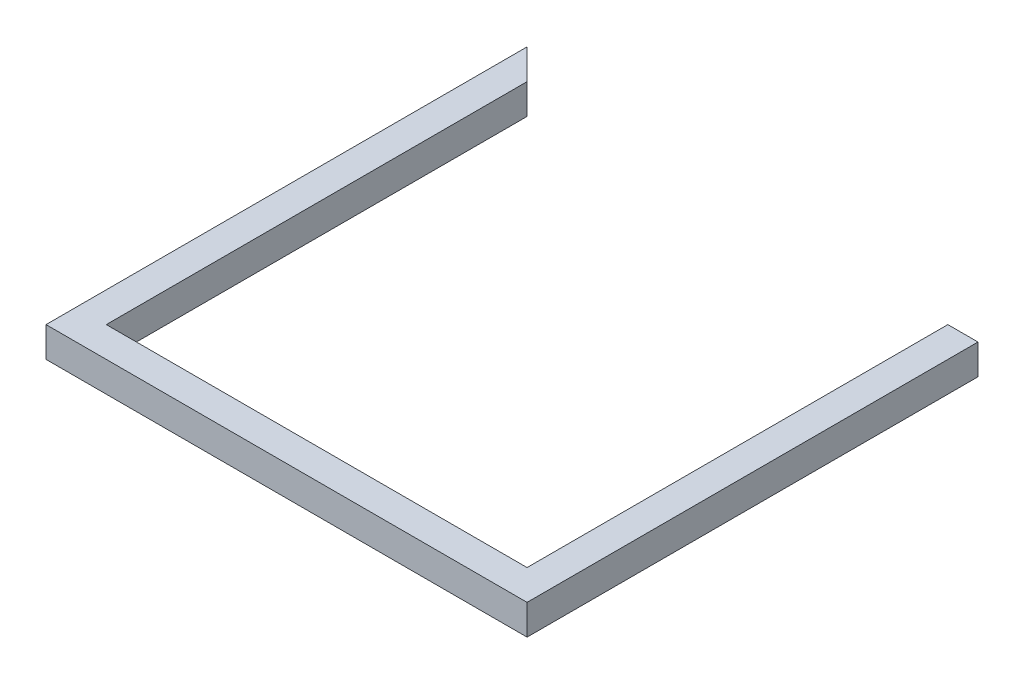
ISO-10303-21;
HEADER;
FILE_DESCRIPTION(('STEP AP214'),'2;1');
FILE_NAME('part.step','',(''),(''),'','','');
FILE_SCHEMA(('AUTOMOTIVE_DESIGN { 1 0 10303 214 1 1 1 1 }'));
ENDSEC;
DATA;
#1=APPLICATION_CONTEXT('core data for automotive mechanical design processes');
#2=APPLICATION_PROTOCOL_DEFINITION('international standard','automotive_design',2000,#1);
#3=PRODUCT_CONTEXT('',#1,'mechanical');
#4=PRODUCT('Part','Part','',(#3));
#5=PRODUCT_RELATED_PRODUCT_CATEGORY('part','',(#4));
#6=PRODUCT_DEFINITION_FORMATION('','',#4);
#7=PRODUCT_DEFINITION_CONTEXT('part definition',#1,'design');
#8=PRODUCT_DEFINITION('design','',#6,#7);
#9=PRODUCT_DEFINITION_SHAPE('','',#8);
#10=(LENGTH_UNIT() NAMED_UNIT(*) SI_UNIT(.MILLI.,.METRE.));
#11=(NAMED_UNIT(*) PLANE_ANGLE_UNIT() SI_UNIT($,.RADIAN.));
#12=(NAMED_UNIT(*) SI_UNIT($,.STERADIAN.) SOLID_ANGLE_UNIT());
#13=UNCERTAINTY_MEASURE_WITH_UNIT(LENGTH_MEASURE(1.E-05),#10,'distance_accuracy_value','');
#14=(GEOMETRIC_REPRESENTATION_CONTEXT(3) GLOBAL_UNCERTAINTY_ASSIGNED_CONTEXT((#13)) GLOBAL_UNIT_ASSIGNED_CONTEXT((#10,
#11,#12)) REPRESENTATION_CONTEXT('',''));
#15=CARTESIAN_POINT('',(0.,0.,0.));
#16=DIRECTION('',(0.,0.,1.));
#17=DIRECTION('',(1.,0.,0.));
#18=AXIS2_PLACEMENT_3D('',#15,#16,#17);
#19=CARTESIAN_POINT('',(0.,25.,0.));
#20=DIRECTION('',(-0.707106781186548,0.,0.707106781186548));
#21=DIRECTION('',(0.707106781186548,0.,0.707106781186548));
#22=AXIS2_PLACEMENT_3D('',#19,#20,#21);
#23=PLANE('',#22);
#24=DIRECTION('',(-0.707106781186548,0.,-0.707106781186548));
#25=VECTOR('',#24,1.);
#26=CARTESIAN_POINT('',(0.,0.,0.));
#27=LINE('',#26,#25);
#28=CARTESIAN_POINT('',(-174.5,0.,-174.5));
#29=VERTEX_POINT('',#28);
#30=CARTESIAN_POINT('',(-199.5,0.,-199.5));
#31=VERTEX_POINT('',#30);
#32=EDGE_CURVE('E241',#29,#31,#27,.T.);
#33=ORIENTED_EDGE('',*,*,#32,.T.);
#34=DIRECTION('',(0.,-1.,0.));
#35=VECTOR('',#34,1.);
#36=CARTESIAN_POINT('',(-199.5,25.,-199.5));
#37=LINE('',#36,#35);
#38=CARTESIAN_POINT('',(-199.5,25.,-199.5));
#39=VERTEX_POINT('',#38);
#40=EDGE_CURVE('E43',#39,#31,#37,.T.);
#41=ORIENTED_EDGE('',*,*,#40,.F.);
#42=DIRECTION('',(-0.707106781186548,0.,-0.707106781186548));
#43=VECTOR('',#42,1.);
#44=CARTESIAN_POINT('',(0.,25.,0.));
#45=LINE('',#44,#43);
#46=CARTESIAN_POINT('',(-174.5,25.,-174.5));
#47=VERTEX_POINT('',#46);
#48=EDGE_CURVE('E220',#47,#39,#45,.T.);
#49=ORIENTED_EDGE('',*,*,#48,.F.);
#50=DIRECTION('',(0.,-1.,0.));
#51=VECTOR('',#50,1.);
#52=CARTESIAN_POINT('',(-174.5,25.,-174.5));
#53=LINE('',#52,#51);
#54=EDGE_CURVE('E11',#47,#29,#53,.T.);
#55=ORIENTED_EDGE('',*,*,#54,.T.);
#56=EDGE_LOOP('',(#33,#41,#49,#55));
#57=FACE_BOUND('',#56,.T.);
#58=DIRECTION('',(-0.707106781186548,0.,-0.707106781186548));
#59=VECTOR('',#58,1.);
#60=CARTESIAN_POINT('',(0.,3.,0.));
#61=LINE('',#60,#59);
#62=CARTESIAN_POINT('',(-177.5,3.,-177.5));
#63=VERTEX_POINT('',#62);
#64=CARTESIAN_POINT('',(-196.5,3.,-196.5));
#65=VERTEX_POINT('',#64);
#66=EDGE_CURVE('E166',#63,#65,#61,.T.);
#67=ORIENTED_EDGE('',*,*,#66,.F.);
#68=DIRECTION('',(0.,-1.,0.));
#69=VECTOR('',#68,1.);
#70=CARTESIAN_POINT('',(-177.5,25.,-177.5));
#71=LINE('',#70,#69);
#72=CARTESIAN_POINT('',(-177.5,22.,-177.5));
#73=VERTEX_POINT('',#72);
#74=EDGE_CURVE('E163',#73,#63,#71,.T.);
#75=ORIENTED_EDGE('',*,*,#74,.F.);
#76=DIRECTION('',(-0.707106781186548,0.,-0.707106781186548));
#77=VECTOR('',#76,1.);
#78=CARTESIAN_POINT('',(0.,22.,0.));
#79=LINE('',#78,#77);
#80=CARTESIAN_POINT('',(-196.5,22.,-196.5));
#81=VERTEX_POINT('',#80);
#82=EDGE_CURVE('E173',#73,#81,#79,.T.);
#83=ORIENTED_EDGE('',*,*,#82,.T.);
#84=DIRECTION('',(0.,-1.,0.));
#85=VECTOR('',#84,1.);
#86=CARTESIAN_POINT('',(-196.5,25.,-196.5));
#87=LINE('',#86,#85);
#88=EDGE_CURVE('E195',#81,#65,#87,.T.);
#89=ORIENTED_EDGE('',*,*,#88,.T.);
#90=EDGE_LOOP('',(#67,#75,#83,#89));
#91=FACE_BOUND('',#90,.T.);
#92=ADVANCED_FACE('F35',(#57,#91),#23,.F.);
#93=CARTESIAN_POINT('',(0.,25.,-174.5));
#94=DIRECTION('',(0.,0.,-1.));
#95=DIRECTION('',(-1.,0.,0.));
#96=AXIS2_PLACEMENT_3D('',#93,#94,#95);
#97=PLANE('',#96);
#98=DIRECTION('',(1.,0.,0.));
#99=VECTOR('',#98,1.);
#100=CARTESIAN_POINT('',(0.,0.,-174.5));
#101=LINE('',#100,#99);
#102=CARTESIAN_POINT('',(174.5,0.,-174.5));
#103=VERTEX_POINT('',#102);
#104=CARTESIAN_POINT('',(199.5,0.,-174.5));
#105=VERTEX_POINT('',#104);
#106=EDGE_CURVE('E251',#103,#105,#101,.T.);
#107=ORIENTED_EDGE('',*,*,#106,.F.);
#108=DIRECTION('',(0.,-1.,0.));
#109=VECTOR('',#108,1.);
#110=CARTESIAN_POINT('',(174.5,25.,-174.5));
#111=LINE('',#110,#109);
#112=CARTESIAN_POINT('',(174.5,25.,-174.5));
#113=VERTEX_POINT('',#112);
#114=EDGE_CURVE('E262',#113,#103,#111,.T.);
#115=ORIENTED_EDGE('',*,*,#114,.F.);
#116=DIRECTION('',(1.,0.,0.));
#117=VECTOR('',#116,1.);
#118=CARTESIAN_POINT('',(0.,25.,-174.5));
#119=LINE('',#118,#117);
#120=CARTESIAN_POINT('',(199.5,25.,-174.5));
#121=VERTEX_POINT('',#120);
#122=EDGE_CURVE('E230',#113,#121,#119,.T.);
#123=ORIENTED_EDGE('',*,*,#122,.T.);
#124=DIRECTION('',(0.,-1.,0.));
#125=VECTOR('',#124,1.);
#126=CARTESIAN_POINT('',(199.5,25.,-174.5));
#127=LINE('',#126,#125);
#128=EDGE_CURVE('E264',#121,#105,#127,.T.);
#129=ORIENTED_EDGE('',*,*,#128,.T.);
#130=EDGE_LOOP('',(#107,#115,#123,#129));
#131=FACE_BOUND('',#130,.T.);
#132=DIRECTION('',(0.,-1.,0.));
#133=VECTOR('',#132,1.);
#134=CARTESIAN_POINT('',(177.5,25.,-174.5));
#135=LINE('',#134,#133);
#136=CARTESIAN_POINT('',(177.5,22.,-174.5));
#137=VERTEX_POINT('',#136);
#138=CARTESIAN_POINT('',(177.5,3.,-174.5));
#139=VERTEX_POINT('',#138);
#140=EDGE_CURVE('E180',#137,#139,#135,.T.);
#141=ORIENTED_EDGE('',*,*,#140,.T.);
#142=DIRECTION('',(1.,0.,0.));
#143=VECTOR('',#142,1.);
#144=CARTESIAN_POINT('',(0.,3.,-174.5));
#145=LINE('',#144,#143);
#146=CARTESIAN_POINT('',(196.5,3.,-174.5));
#147=VERTEX_POINT('',#146);
#148=EDGE_CURVE('E175',#139,#147,#145,.T.);
#149=ORIENTED_EDGE('',*,*,#148,.T.);
#150=DIRECTION('',(0.,-1.,0.));
#151=VECTOR('',#150,1.);
#152=CARTESIAN_POINT('',(196.5,25.,-174.5));
#153=LINE('',#152,#151);
#154=CARTESIAN_POINT('',(196.5,22.,-174.5));
#155=VERTEX_POINT('',#154);
#156=EDGE_CURVE('E201',#155,#147,#153,.T.);
#157=ORIENTED_EDGE('',*,*,#156,.F.);
#158=DIRECTION('',(1.,0.,0.));
#159=VECTOR('',#158,1.);
#160=CARTESIAN_POINT('',(0.,22.,-174.5));
#161=LINE('',#160,#159);
#162=EDGE_CURVE('E58',#137,#155,#161,.T.);
#163=ORIENTED_EDGE('',*,*,#162,.F.);
#164=EDGE_LOOP('',(#141,#149,#157,#163));
#165=FACE_BOUND('',#164,.T.);
#166=ADVANCED_FACE('F307',(#131,#165),#97,.T.);
#167=CARTESIAN_POINT('',(-174.5,25.,0.));
#168=DIRECTION('',(1.,0.,0.));
#169=DIRECTION('',(0.,0.,-1.));
#170=AXIS2_PLACEMENT_3D('',#167,#168,#169);
#171=PLANE('',#170);
#172=DIRECTION('',(0.,0.,1.));
#173=VECTOR('',#172,1.);
#174=CARTESIAN_POINT('',(-174.5,0.,0.));
#175=LINE('',#174,#173);
#176=CARTESIAN_POINT('',(-174.5,0.,174.5));
#177=VERTEX_POINT('',#176);
#178=EDGE_CURVE('E205',#29,#177,#175,.T.);
#179=ORIENTED_EDGE('',*,*,#178,.F.);
#180=ORIENTED_EDGE('',*,*,#54,.F.);
#181=DIRECTION('',(0.,0.,1.));
#182=VECTOR('',#181,1.);
#183=CARTESIAN_POINT('',(-174.5,25.,0.));
#184=LINE('',#183,#182);
#185=CARTESIAN_POINT('',(-174.5,25.,174.5));
#186=VERTEX_POINT('',#185);
#187=EDGE_CURVE('E217',#47,#186,#184,.T.);
#188=ORIENTED_EDGE('',*,*,#187,.T.);
#189=DIRECTION('',(0.,-1.,0.));
#190=VECTOR('',#189,1.);
#191=CARTESIAN_POINT('',(-174.5,25.,174.5));
#192=LINE('',#191,#190);
#193=EDGE_CURVE('E238',#186,#177,#192,.T.);
#194=ORIENTED_EDGE('',*,*,#193,.T.);
#195=EDGE_LOOP('',(#179,#180,#188,#194));
#196=FACE_BOUND('',#195,.T.);
#197=ADVANCED_FACE('F37',(#196),#171,.T.);
#198=CARTESIAN_POINT('',(-199.5,25.,0.));
#199=DIRECTION('',(1.,0.,0.));
#200=DIRECTION('',(0.,0.,-1.));
#201=AXIS2_PLACEMENT_3D('',#198,#199,#200);
#202=PLANE('',#201);
#203=DIRECTION('',(0.,0.,1.));
#204=VECTOR('',#203,1.);
#205=CARTESIAN_POINT('',(-199.5,0.,0.));
#206=LINE('',#205,#204);
#207=CARTESIAN_POINT('',(-199.5,0.,199.5));
#208=VERTEX_POINT('',#207);
#209=EDGE_CURVE('E243',#31,#208,#206,.T.);
#210=ORIENTED_EDGE('',*,*,#209,.T.);
#211=DIRECTION('',(0.,-1.,0.));
#212=VECTOR('',#211,1.);
#213=CARTESIAN_POINT('',(-199.5,25.,199.5));
#214=LINE('',#213,#212);
#215=CARTESIAN_POINT('',(-199.5,25.,199.5));
#216=VERTEX_POINT('',#215);
#217=EDGE_CURVE('E268',#216,#208,#214,.T.);
#218=ORIENTED_EDGE('',*,*,#217,.F.);
#219=DIRECTION('',(0.,0.,1.));
#220=VECTOR('',#219,1.);
#221=CARTESIAN_POINT('',(-199.5,25.,0.));
#222=LINE('',#221,#220);
#223=EDGE_CURVE('E223',#39,#216,#222,.T.);
#224=ORIENTED_EDGE('',*,*,#223,.F.);
#225=ORIENTED_EDGE('',*,*,#40,.T.);
#226=EDGE_LOOP('',(#210,#218,#224,#225));
#227=FACE_BOUND('',#226,.T.);
#228=ADVANCED_FACE('F275',(#227),#202,.F.);
#229=CARTESIAN_POINT('',(0.,25.,199.5));
#230=DIRECTION('',(0.,0.,-1.));
#231=DIRECTION('',(-1.,0.,0.));
#232=AXIS2_PLACEMENT_3D('',#229,#230,#231);
#233=PLANE('',#232);
#234=DIRECTION('',(1.,0.,0.));
#235=VECTOR('',#234,1.);
#236=CARTESIAN_POINT('',(0.,0.,199.5));
#237=LINE('',#236,#235);
#238=CARTESIAN_POINT('',(199.5,0.,199.5));
#239=VERTEX_POINT('',#238);
#240=EDGE_CURVE('E245',#208,#239,#237,.T.);
#241=ORIENTED_EDGE('',*,*,#240,.T.);
#242=DIRECTION('',(0.,-1.,0.));
#243=VECTOR('',#242,1.);
#244=CARTESIAN_POINT('',(199.5,25.,199.5));
#245=LINE('',#244,#243);
#246=CARTESIAN_POINT('',(199.5,25.,199.5));
#247=VERTEX_POINT('',#246);
#248=EDGE_CURVE('E266',#247,#239,#245,.T.);
#249=ORIENTED_EDGE('',*,*,#248,.F.);
#250=DIRECTION('',(1.,0.,0.));
#251=VECTOR('',#250,1.);
#252=CARTESIAN_POINT('',(0.,25.,199.5));
#253=LINE('',#252,#251);
#254=EDGE_CURVE('E225',#216,#247,#253,.T.);
#255=ORIENTED_EDGE('',*,*,#254,.F.);
#256=ORIENTED_EDGE('',*,*,#217,.T.);
#257=EDGE_LOOP('',(#241,#249,#255,#256));
#258=FACE_BOUND('',#257,.T.);
#259=ADVANCED_FACE('F287',(#258),#233,.F.);
#260=CARTESIAN_POINT('',(199.5,25.,0.));
#261=DIRECTION('',(1.,0.,0.));
#262=DIRECTION('',(0.,0.,-1.));
#263=AXIS2_PLACEMENT_3D('',#260,#261,#262);
#264=PLANE('',#263);
#265=DIRECTION('',(0.,0.,1.));
#266=VECTOR('',#265,1.);
#267=CARTESIAN_POINT('',(199.5,0.,0.));
#268=LINE('',#267,#266);
#269=EDGE_CURVE('E248',#105,#239,#268,.T.);
#270=ORIENTED_EDGE('',*,*,#269,.F.);
#271=ORIENTED_EDGE('',*,*,#128,.F.);
#272=DIRECTION('',(0.,0.,1.));
#273=VECTOR('',#272,1.);
#274=CARTESIAN_POINT('',(199.5,25.,0.));
#275=LINE('',#274,#273);
#276=EDGE_CURVE('E227',#121,#247,#275,.T.);
#277=ORIENTED_EDGE('',*,*,#276,.T.);
#278=ORIENTED_EDGE('',*,*,#248,.T.);
#279=EDGE_LOOP('',(#270,#271,#277,#278));
#280=FACE_BOUND('',#279,.T.);
#281=ADVANCED_FACE('F310',(#280),#264,.T.);
#282=CARTESIAN_POINT('',(174.5,25.,0.));
#283=DIRECTION('',(1.,0.,0.));
#284=DIRECTION('',(0.,0.,-1.));
#285=AXIS2_PLACEMENT_3D('',#282,#283,#284);
#286=PLANE('',#285);
#287=DIRECTION('',(0.,0.,1.));
#288=VECTOR('',#287,1.);
#289=CARTESIAN_POINT('',(174.5,0.,0.));
#290=LINE('',#289,#288);
#291=CARTESIAN_POINT('',(174.5,0.,174.5));
#292=VERTEX_POINT('',#291);
#293=EDGE_CURVE('E254',#103,#292,#290,.T.);
#294=ORIENTED_EDGE('',*,*,#293,.T.);
#295=DIRECTION('',(0.,-1.,0.));
#296=VECTOR('',#295,1.);
#297=CARTESIAN_POINT('',(174.5,25.,174.5));
#298=LINE('',#297,#296);
#299=CARTESIAN_POINT('',(174.5,25.,174.5));
#300=VERTEX_POINT('',#299);
#301=EDGE_CURVE('E260',#300,#292,#298,.T.);
#302=ORIENTED_EDGE('',*,*,#301,.F.);
#303=DIRECTION('',(0.,0.,1.));
#304=VECTOR('',#303,1.);
#305=CARTESIAN_POINT('',(174.5,25.,0.));
#306=LINE('',#305,#304);
#307=EDGE_CURVE('E233',#113,#300,#306,.T.);
#308=ORIENTED_EDGE('',*,*,#307,.F.);
#309=ORIENTED_EDGE('',*,*,#114,.T.);
#310=EDGE_LOOP('',(#294,#302,#308,#309));
#311=FACE_BOUND('',#310,.T.);
#312=ADVANCED_FACE('F304',(#311),#286,.F.);
#313=CARTESIAN_POINT('',(0.,25.,174.5));
#314=DIRECTION('',(0.,0.,-1.));
#315=DIRECTION('',(-1.,0.,0.));
#316=AXIS2_PLACEMENT_3D('',#313,#314,#315);
#317=PLANE('',#316);
#318=DIRECTION('',(1.,0.,0.));
#319=VECTOR('',#318,1.);
#320=CARTESIAN_POINT('',(0.,0.,174.5));
#321=LINE('',#320,#319);
#322=EDGE_CURVE('E221',#177,#292,#321,.T.);
#323=ORIENTED_EDGE('',*,*,#322,.F.);
#324=ORIENTED_EDGE('',*,*,#193,.F.);
#325=DIRECTION('',(1.,0.,0.));
#326=VECTOR('',#325,1.);
#327=CARTESIAN_POINT('',(0.,25.,174.5));
#328=LINE('',#327,#326);
#329=EDGE_CURVE('E235',#186,#300,#328,.T.);
#330=ORIENTED_EDGE('',*,*,#329,.T.);
#331=ORIENTED_EDGE('',*,*,#301,.T.);
#332=EDGE_LOOP('',(#323,#324,#330,#331));
#333=FACE_BOUND('',#332,.T.);
#334=ADVANCED_FACE('F300',(#333),#317,.T.);
#335=CARTESIAN_POINT('',(0.,25.,0.));
#336=DIRECTION('',(0.,1.,0.));
#337=DIRECTION('',(0.,0.,1.));
#338=AXIS2_PLACEMENT_3D('',#335,#336,#337);
#339=PLANE('',#338);
#340=ORIENTED_EDGE('',*,*,#187,.F.);
#341=ORIENTED_EDGE('',*,*,#48,.T.);
#342=ORIENTED_EDGE('',*,*,#223,.T.);
#343=ORIENTED_EDGE('',*,*,#254,.T.);
#344=ORIENTED_EDGE('',*,*,#276,.F.);
#345=ORIENTED_EDGE('',*,*,#122,.F.);
#346=ORIENTED_EDGE('',*,*,#307,.T.);
#347=ORIENTED_EDGE('',*,*,#329,.F.);
#348=EDGE_LOOP('',(#340,#341,#342,#343,#344,#345,#346,#347));
#349=FACE_BOUND('',#348,.T.);
#350=ADVANCED_FACE('F292',(#349),#339,.T.);
#351=CARTESIAN_POINT('',(0.,0.,0.));
#352=DIRECTION('',(0.,1.,0.));
#353=DIRECTION('',(0.,0.,1.));
#354=AXIS2_PLACEMENT_3D('',#351,#352,#353);
#355=PLANE('',#354);
#356=ORIENTED_EDGE('',*,*,#178,.T.);
#357=ORIENTED_EDGE('',*,*,#322,.T.);
#358=ORIENTED_EDGE('',*,*,#293,.F.);
#359=ORIENTED_EDGE('',*,*,#106,.T.);
#360=ORIENTED_EDGE('',*,*,#269,.T.);
#361=ORIENTED_EDGE('',*,*,#240,.F.);
#362=ORIENTED_EDGE('',*,*,#209,.F.);
#363=ORIENTED_EDGE('',*,*,#32,.F.);
#364=EDGE_LOOP('',(#356,#357,#358,#359,#360,#361,#362,#363));
#365=FACE_BOUND('',#364,.T.);
#366=ADVANCED_FACE('F282',(#365),#355,.F.);
#367=CARTESIAN_POINT('',(-177.5,25.,0.));
#368=DIRECTION('',(1.,0.,0.));
#369=DIRECTION('',(0.,0.,-1.));
#370=AXIS2_PLACEMENT_3D('',#367,#368,#369);
#371=PLANE('',#370);
#372=DIRECTION('',(0.,0.,1.));
#373=VECTOR('',#372,1.);
#374=CARTESIAN_POINT('',(-177.5,3.,0.));
#375=LINE('',#374,#373);
#376=CARTESIAN_POINT('',(-177.5,3.,177.5));
#377=VERTEX_POINT('',#376);
#378=EDGE_CURVE('E160',#63,#377,#375,.T.);
#379=ORIENTED_EDGE('',*,*,#378,.T.);
#380=DIRECTION('',(0.,-1.,0.));
#381=VECTOR('',#380,1.);
#382=CARTESIAN_POINT('',(-177.5,25.,177.5));
#383=LINE('',#382,#381);
#384=CARTESIAN_POINT('',(-177.5,22.,177.5));
#385=VERTEX_POINT('',#384);
#386=EDGE_CURVE('E149',#385,#377,#383,.T.);
#387=ORIENTED_EDGE('',*,*,#386,.F.);
#388=DIRECTION('',(0.,0.,1.));
#389=VECTOR('',#388,1.);
#390=CARTESIAN_POINT('',(-177.5,22.,0.));
#391=LINE('',#390,#389);
#392=EDGE_CURVE('E50',#73,#385,#391,.T.);
#393=ORIENTED_EDGE('',*,*,#392,.F.);
#394=ORIENTED_EDGE('',*,*,#74,.T.);
#395=EDGE_LOOP('',(#379,#387,#393,#394));
#396=FACE_BOUND('',#395,.T.);
#397=ADVANCED_FACE('F161',(#396),#371,.F.);
#398=CARTESIAN_POINT('',(-196.5,25.,0.));
#399=DIRECTION('',(1.,0.,0.));
#400=DIRECTION('',(0.,0.,-1.));
#401=AXIS2_PLACEMENT_3D('',#398,#399,#400);
#402=PLANE('',#401);
#403=DIRECTION('',(0.,0.,1.));
#404=VECTOR('',#403,1.);
#405=CARTESIAN_POINT('',(-196.5,3.,0.));
#406=LINE('',#405,#404);
#407=CARTESIAN_POINT('',(-196.5,3.,196.5));
#408=VERTEX_POINT('',#407);
#409=EDGE_CURVE('E189',#65,#408,#406,.T.);
#410=ORIENTED_EDGE('',*,*,#409,.F.);
#411=ORIENTED_EDGE('',*,*,#88,.F.);
#412=DIRECTION('',(0.,0.,1.));
#413=VECTOR('',#412,1.);
#414=CARTESIAN_POINT('',(-196.5,22.,0.));
#415=LINE('',#414,#413);
#416=CARTESIAN_POINT('',(-196.5,22.,196.5));
#417=VERTEX_POINT('',#416);
#418=EDGE_CURVE('E183',#81,#417,#415,.T.);
#419=ORIENTED_EDGE('',*,*,#418,.T.);
#420=DIRECTION('',(0.,-1.,0.));
#421=VECTOR('',#420,1.);
#422=CARTESIAN_POINT('',(-196.5,25.,196.5));
#423=LINE('',#422,#421);
#424=EDGE_CURVE('E192',#417,#408,#423,.T.);
#425=ORIENTED_EDGE('',*,*,#424,.T.);
#426=EDGE_LOOP('',(#410,#411,#419,#425));
#427=FACE_BOUND('',#426,.T.);
#428=ADVANCED_FACE('F348',(#427),#402,.T.);
#429=CARTESIAN_POINT('',(0.,25.,196.5));
#430=DIRECTION('',(0.,0.,-1.));
#431=DIRECTION('',(-1.,0.,0.));
#432=AXIS2_PLACEMENT_3D('',#429,#430,#431);
#433=PLANE('',#432);
#434=DIRECTION('',(1.,0.,0.));
#435=VECTOR('',#434,1.);
#436=CARTESIAN_POINT('',(0.,3.,196.5));
#437=LINE('',#436,#435);
#438=CARTESIAN_POINT('',(196.5,3.,196.5));
#439=VERTEX_POINT('',#438);
#440=EDGE_CURVE('E191',#408,#439,#437,.T.);
#441=ORIENTED_EDGE('',*,*,#440,.F.);
#442=ORIENTED_EDGE('',*,*,#424,.F.);
#443=DIRECTION('',(1.,0.,0.));
#444=VECTOR('',#443,1.);
#445=CARTESIAN_POINT('',(0.,22.,196.5));
#446=LINE('',#445,#444);
#447=CARTESIAN_POINT('',(196.5,22.,196.5));
#448=VERTEX_POINT('',#447);
#449=EDGE_CURVE('E185',#417,#448,#446,.T.);
#450=ORIENTED_EDGE('',*,*,#449,.T.);
#451=DIRECTION('',(0.,-1.,0.));
#452=VECTOR('',#451,1.);
#453=CARTESIAN_POINT('',(196.5,25.,196.5));
#454=LINE('',#453,#452);
#455=EDGE_CURVE('E196',#448,#439,#454,.T.);
#456=ORIENTED_EDGE('',*,*,#455,.T.);
#457=EDGE_LOOP('',(#441,#442,#450,#456));
#458=FACE_BOUND('',#457,.T.);
#459=ADVANCED_FACE('F358',(#458),#433,.T.);
#460=CARTESIAN_POINT('',(196.5,25.,0.));
#461=DIRECTION('',(1.,0.,0.));
#462=DIRECTION('',(0.,0.,-1.));
#463=AXIS2_PLACEMENT_3D('',#460,#461,#462);
#464=PLANE('',#463);
#465=DIRECTION('',(0.,0.,1.));
#466=VECTOR('',#465,1.);
#467=CARTESIAN_POINT('',(196.5,3.,0.));
#468=LINE('',#467,#466);
#469=EDGE_CURVE('E199',#147,#439,#468,.T.);
#470=ORIENTED_EDGE('',*,*,#469,.T.);
#471=ORIENTED_EDGE('',*,*,#455,.F.);
#472=DIRECTION('',(0.,0.,1.));
#473=VECTOR('',#472,1.);
#474=CARTESIAN_POINT('',(196.5,22.,0.));
#475=LINE('',#474,#473);
#476=EDGE_CURVE('E187',#155,#448,#475,.T.);
#477=ORIENTED_EDGE('',*,*,#476,.F.);
#478=ORIENTED_EDGE('',*,*,#156,.T.);
#479=EDGE_LOOP('',(#470,#471,#477,#478));
#480=FACE_BOUND('',#479,.T.);
#481=ADVANCED_FACE('F368',(#480),#464,.F.);
#482=CARTESIAN_POINT('',(177.5,25.,0.));
#483=DIRECTION('',(1.,0.,0.));
#484=DIRECTION('',(0.,0.,-1.));
#485=AXIS2_PLACEMENT_3D('',#482,#483,#484);
#486=PLANE('',#485);
#487=DIRECTION('',(0.,0.,1.));
#488=VECTOR('',#487,1.);
#489=CARTESIAN_POINT('',(177.5,3.,0.));
#490=LINE('',#489,#488);
#491=CARTESIAN_POINT('',(177.5,3.,177.5));
#492=VERTEX_POINT('',#491);
#493=EDGE_CURVE('E171',#139,#492,#490,.T.);
#494=ORIENTED_EDGE('',*,*,#493,.F.);
#495=ORIENTED_EDGE('',*,*,#140,.F.);
#496=DIRECTION('',(0.,0.,1.));
#497=VECTOR('',#496,1.);
#498=CARTESIAN_POINT('',(177.5,22.,0.));
#499=LINE('',#498,#497);
#500=CARTESIAN_POINT('',(177.5,22.,177.5));
#501=VERTEX_POINT('',#500);
#502=EDGE_CURVE('E179',#137,#501,#499,.T.);
#503=ORIENTED_EDGE('',*,*,#502,.T.);
#504=DIRECTION('',(0.,-1.,0.));
#505=VECTOR('',#504,1.);
#506=CARTESIAN_POINT('',(177.5,25.,177.5));
#507=LINE('',#506,#505);
#508=EDGE_CURVE('E157',#501,#492,#507,.T.);
#509=ORIENTED_EDGE('',*,*,#508,.T.);
#510=EDGE_LOOP('',(#494,#495,#503,#509));
#511=FACE_BOUND('',#510,.T.);
#512=ADVANCED_FACE('F378',(#511),#486,.T.);
#513=CARTESIAN_POINT('',(0.,25.,177.5));
#514=DIRECTION('',(0.,0.,-1.));
#515=DIRECTION('',(-1.,0.,0.));
#516=AXIS2_PLACEMENT_3D('',#513,#514,#515);
#517=PLANE('',#516);
#518=DIRECTION('',(1.,0.,0.));
#519=VECTOR('',#518,1.);
#520=CARTESIAN_POINT('',(0.,3.,177.5));
#521=LINE('',#520,#519);
#522=EDGE_CURVE('E154',#377,#492,#521,.T.);
#523=ORIENTED_EDGE('',*,*,#522,.T.);
#524=ORIENTED_EDGE('',*,*,#508,.F.);
#525=DIRECTION('',(1.,0.,0.));
#526=VECTOR('',#525,1.);
#527=CARTESIAN_POINT('',(0.,22.,177.5));
#528=LINE('',#527,#526);
#529=EDGE_CURVE('E156',#385,#501,#528,.T.);
#530=ORIENTED_EDGE('',*,*,#529,.F.);
#531=ORIENTED_EDGE('',*,*,#386,.T.);
#532=EDGE_LOOP('',(#523,#524,#530,#531));
#533=FACE_BOUND('',#532,.T.);
#534=ADVANCED_FACE('F151',(#533),#517,.F.);
#535=CARTESIAN_POINT('',(0.,22.,0.));
#536=DIRECTION('',(0.,1.,0.));
#537=DIRECTION('',(0.,0.,1.));
#538=AXIS2_PLACEMENT_3D('',#535,#536,#537);
#539=PLANE('',#538);
#540=ORIENTED_EDGE('',*,*,#392,.T.);
#541=ORIENTED_EDGE('',*,*,#529,.T.);
#542=ORIENTED_EDGE('',*,*,#502,.F.);
#543=ORIENTED_EDGE('',*,*,#162,.T.);
#544=ORIENTED_EDGE('',*,*,#476,.T.);
#545=ORIENTED_EDGE('',*,*,#449,.F.);
#546=ORIENTED_EDGE('',*,*,#418,.F.);
#547=ORIENTED_EDGE('',*,*,#82,.F.);
#548=EDGE_LOOP('',(#540,#541,#542,#543,#544,#545,#546,#547));
#549=FACE_BOUND('',#548,.T.);
#550=ADVANCED_FACE('F397',(#549),#539,.F.);
#551=CARTESIAN_POINT('',(0.,3.,0.));
#552=DIRECTION('',(0.,1.,0.));
#553=DIRECTION('',(0.,0.,1.));
#554=AXIS2_PLACEMENT_3D('',#551,#552,#553);
#555=PLANE('',#554);
#556=ORIENTED_EDGE('',*,*,#378,.F.);
#557=ORIENTED_EDGE('',*,*,#66,.T.);
#558=ORIENTED_EDGE('',*,*,#409,.T.);
#559=ORIENTED_EDGE('',*,*,#440,.T.);
#560=ORIENTED_EDGE('',*,*,#469,.F.);
#561=ORIENTED_EDGE('',*,*,#148,.F.);
#562=ORIENTED_EDGE('',*,*,#493,.T.);
#563=ORIENTED_EDGE('',*,*,#522,.F.);
#564=EDGE_LOOP('',(#556,#557,#558,#559,#560,#561,#562,#563));
#565=FACE_BOUND('',#564,.T.);
#566=ADVANCED_FACE('F169',(#565),#555,.T.);
#567=CLOSED_SHELL('',(#92,#166,#197,#228,#259,#281,#312,#334,#350,#366,#397,#428,#459,#481,#512,
#534,#550,#566));
#568=MANIFOLD_SOLID_BREP('B2',#567);
#569=ADVANCED_BREP_SHAPE_REPRESENTATION('',(#18,#568),#14);
#570=SHAPE_DEFINITION_REPRESENTATION(#9,#569);
ENDSEC;
END-ISO-10303-21;
